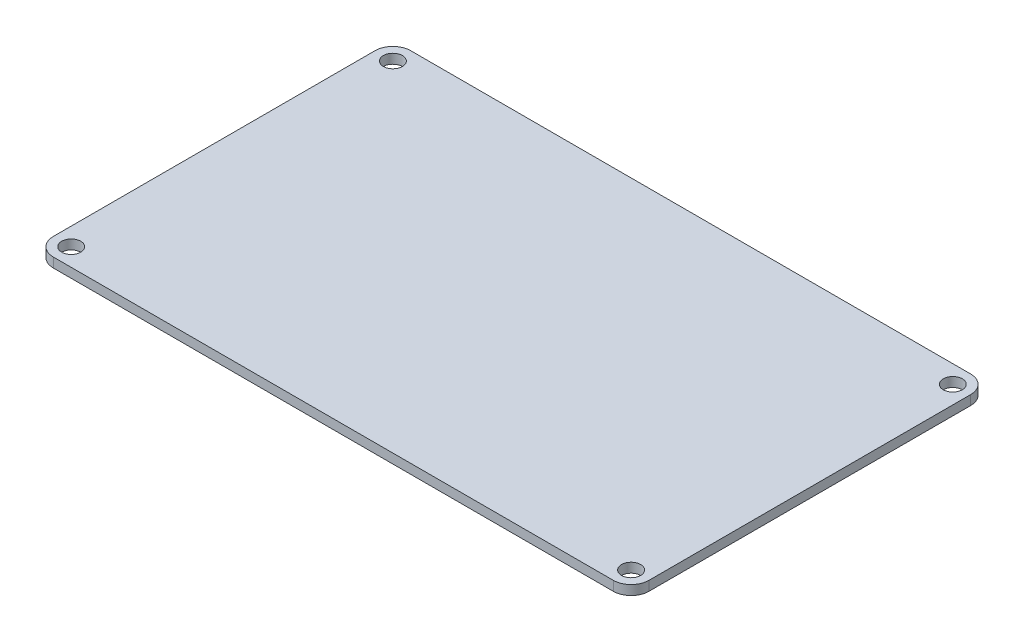
ISO-10303-21;
HEADER;
FILE_DESCRIPTION(('STEP AP214'),'2;1');
FILE_NAME('part.step','',(''),(''),'','','');
FILE_SCHEMA(('AUTOMOTIVE_DESIGN { 1 0 10303 214 1 1 1 1 }'));
ENDSEC;
DATA;
#1=APPLICATION_CONTEXT('core data for automotive mechanical design processes');
#2=APPLICATION_PROTOCOL_DEFINITION('international standard','automotive_design',2000,#1);
#3=PRODUCT_CONTEXT('',#1,'mechanical');
#4=PRODUCT('Part','Part','',(#3));
#5=PRODUCT_RELATED_PRODUCT_CATEGORY('part','',(#4));
#6=PRODUCT_DEFINITION_FORMATION('','',#4);
#7=PRODUCT_DEFINITION_CONTEXT('part definition',#1,'design');
#8=PRODUCT_DEFINITION('design','',#6,#7);
#9=PRODUCT_DEFINITION_SHAPE('','',#8);
#10=(LENGTH_UNIT() NAMED_UNIT(*) SI_UNIT(.MILLI.,.METRE.));
#11=(NAMED_UNIT(*) PLANE_ANGLE_UNIT() SI_UNIT($,.RADIAN.));
#12=(NAMED_UNIT(*) SI_UNIT($,.STERADIAN.) SOLID_ANGLE_UNIT());
#13=UNCERTAINTY_MEASURE_WITH_UNIT(LENGTH_MEASURE(1.E-05),#10,'distance_accuracy_value','');
#14=(GEOMETRIC_REPRESENTATION_CONTEXT(3) GLOBAL_UNCERTAINTY_ASSIGNED_CONTEXT((#13)) GLOBAL_UNIT_ASSIGNED_CONTEXT((#10,
#11,#12)) REPRESENTATION_CONTEXT('',''));
#15=CARTESIAN_POINT('',(0.,0.,0.));
#16=DIRECTION('',(0.,0.,1.));
#17=DIRECTION('',(1.,0.,0.));
#18=AXIS2_PLACEMENT_3D('',#15,#16,#17);
#19=CARTESIAN_POINT('',(-50.,1.6,30.));
#20=DIRECTION('',(0.,0.,-1.));
#21=DIRECTION('',(-1.,0.,0.));
#22=AXIS2_PLACEMENT_3D('',#19,#20,#21);
#23=PLANE('',#22);
#24=DIRECTION('',(1.,0.,0.));
#25=VECTOR('',#24,1.);
#26=CARTESIAN_POINT('',(-50.,0.,30.));
#27=LINE('',#26,#25);
#28=CARTESIAN_POINT('',(-47.,0.,30.));
#29=VERTEX_POINT('',#28);
#30=CARTESIAN_POINT('',(47.,0.,30.));
#31=VERTEX_POINT('',#30);
#32=EDGE_CURVE('E158',#29,#31,#27,.T.);
#33=ORIENTED_EDGE('',*,*,#32,.T.);
#34=DIRECTION('',(0.,-1.,0.));
#35=VECTOR('',#34,1.);
#36=CARTESIAN_POINT('',(47.,1.6,30.));
#37=LINE('',#36,#35);
#38=CARTESIAN_POINT('',(47.,1.6,30.));
#39=VERTEX_POINT('',#38);
#40=EDGE_CURVE('E145',#31,#39,#37,.F.);
#41=ORIENTED_EDGE('',*,*,#40,.T.);
#42=DIRECTION('',(1.,0.,0.));
#43=VECTOR('',#42,1.);
#44=CARTESIAN_POINT('',(-50.,1.6,30.));
#45=LINE('',#44,#43);
#46=CARTESIAN_POINT('',(-47.,1.6,30.));
#47=VERTEX_POINT('',#46);
#48=EDGE_CURVE('E160',#47,#39,#45,.T.);
#49=ORIENTED_EDGE('',*,*,#48,.F.);
#50=DIRECTION('',(0.,-1.,0.));
#51=VECTOR('',#50,1.);
#52=CARTESIAN_POINT('',(-47.,1.6,30.));
#53=LINE('',#52,#51);
#54=EDGE_CURVE('E142',#47,#29,#53,.T.);
#55=ORIENTED_EDGE('',*,*,#54,.T.);
#56=EDGE_LOOP('',(#33,#41,#49,#55));
#57=FACE_BOUND('',#56,.T.);
#58=ADVANCED_FACE('F33',(#57),#23,.F.);
#59=CARTESIAN_POINT('',(50.,1.6,-30.));
#60=DIRECTION('',(1.,0.,0.));
#61=DIRECTION('',(0.,0.,-1.));
#62=AXIS2_PLACEMENT_3D('',#59,#60,#61);
#63=PLANE('',#62);
#64=DIRECTION('',(0.,0.,1.));
#65=VECTOR('',#64,1.);
#66=CARTESIAN_POINT('',(50.,0.,-30.));
#67=LINE('',#66,#65);
#68=CARTESIAN_POINT('',(50.,0.,-27.));
#69=VERTEX_POINT('',#68);
#70=CARTESIAN_POINT('',(50.,0.,27.));
#71=VERTEX_POINT('',#70);
#72=EDGE_CURVE('E116',#69,#71,#67,.T.);
#73=ORIENTED_EDGE('',*,*,#72,.F.);
#74=DIRECTION('',(0.,-1.,0.));
#75=VECTOR('',#74,1.);
#76=CARTESIAN_POINT('',(50.,1.6,-27.));
#77=LINE('',#76,#75);
#78=CARTESIAN_POINT('',(50.,1.6,-27.));
#79=VERTEX_POINT('',#78);
#80=EDGE_CURVE('E133',#69,#79,#77,.F.);
#81=ORIENTED_EDGE('',*,*,#80,.T.);
#82=DIRECTION('',(0.,0.,1.));
#83=VECTOR('',#82,1.);
#84=CARTESIAN_POINT('',(50.,1.6,-30.));
#85=LINE('',#84,#83);
#86=CARTESIAN_POINT('',(50.,1.6,27.));
#87=VERTEX_POINT('',#86);
#88=EDGE_CURVE('E170',#79,#87,#85,.T.);
#89=ORIENTED_EDGE('',*,*,#88,.T.);
#90=DIRECTION('',(0.,-1.,0.));
#91=VECTOR('',#90,1.);
#92=CARTESIAN_POINT('',(50.,0.,27.));
#93=LINE('',#92,#91);
#94=EDGE_CURVE('E130',#87,#71,#93,.T.);
#95=ORIENTED_EDGE('',*,*,#94,.T.);
#96=EDGE_LOOP('',(#73,#81,#89,#95));
#97=FACE_BOUND('',#96,.T.);
#98=ADVANCED_FACE('F222',(#97),#63,.T.);
#99=CARTESIAN_POINT('',(-50.,1.6,-30.));
#100=DIRECTION('',(0.,0.,-1.));
#101=DIRECTION('',(-1.,0.,0.));
#102=AXIS2_PLACEMENT_3D('',#99,#100,#101);
#103=PLANE('',#102);
#104=DIRECTION('',(1.,0.,0.));
#105=VECTOR('',#104,1.);
#106=CARTESIAN_POINT('',(-50.,1.6,-30.));
#107=LINE('',#106,#105);
#108=CARTESIAN_POINT('',(-47.,1.6,-30.));
#109=VERTEX_POINT('',#108);
#110=CARTESIAN_POINT('',(47.,1.6,-30.));
#111=VERTEX_POINT('',#110);
#112=EDGE_CURVE('E121',#109,#111,#107,.T.);
#113=ORIENTED_EDGE('',*,*,#112,.T.);
#114=DIRECTION('',(0.,-1.,0.));
#115=VECTOR('',#114,1.);
#116=CARTESIAN_POINT('',(47.,1.6,-30.));
#117=LINE('',#116,#115);
#118=CARTESIAN_POINT('',(47.,0.,-30.));
#119=VERTEX_POINT('',#118);
#120=EDGE_CURVE('E108',#111,#119,#117,.T.);
#121=ORIENTED_EDGE('',*,*,#120,.T.);
#122=DIRECTION('',(1.,0.,0.));
#123=VECTOR('',#122,1.);
#124=CARTESIAN_POINT('',(-50.,0.,-30.));
#125=LINE('',#124,#123);
#126=CARTESIAN_POINT('',(-47.,0.,-30.));
#127=VERTEX_POINT('',#126);
#128=EDGE_CURVE('E101',#127,#119,#125,.T.);
#129=ORIENTED_EDGE('',*,*,#128,.F.);
#130=DIRECTION('',(0.,-1.,0.));
#131=VECTOR('',#130,1.);
#132=CARTESIAN_POINT('',(-47.,1.6,-30.));
#133=LINE('',#132,#131);
#134=EDGE_CURVE('E114',#127,#109,#133,.F.);
#135=ORIENTED_EDGE('',*,*,#134,.T.);
#136=EDGE_LOOP('',(#113,#121,#129,#135));
#137=FACE_BOUND('',#136,.T.);
#138=ADVANCED_FACE('F113',(#137),#103,.T.);
#139=CARTESIAN_POINT('',(-50.,1.6,-30.));
#140=DIRECTION('',(1.,0.,0.));
#141=DIRECTION('',(0.,0.,-1.));
#142=AXIS2_PLACEMENT_3D('',#139,#140,#141);
#143=PLANE('',#142);
#144=DIRECTION('',(0.,0.,1.));
#145=VECTOR('',#144,1.);
#146=CARTESIAN_POINT('',(-50.,0.,-30.));
#147=LINE('',#146,#145);
#148=CARTESIAN_POINT('',(-50.,0.,-27.));
#149=VERTEX_POINT('',#148);
#150=CARTESIAN_POINT('',(-50.,0.,27.));
#151=VERTEX_POINT('',#150);
#152=EDGE_CURVE('E102',#149,#151,#147,.T.);
#153=ORIENTED_EDGE('',*,*,#152,.T.);
#154=DIRECTION('',(0.,-1.,0.));
#155=VECTOR('',#154,1.);
#156=CARTESIAN_POINT('',(-50.,1.6,27.));
#157=LINE('',#156,#155);
#158=CARTESIAN_POINT('',(-50.,1.6,27.));
#159=VERTEX_POINT('',#158);
#160=EDGE_CURVE('E11',#151,#159,#157,.F.);
#161=ORIENTED_EDGE('',*,*,#160,.T.);
#162=DIRECTION('',(0.,0.,1.));
#163=VECTOR('',#162,1.);
#164=CARTESIAN_POINT('',(-50.,1.6,-30.));
#165=LINE('',#164,#163);
#166=CARTESIAN_POINT('',(-50.,1.6,-27.));
#167=VERTEX_POINT('',#166);
#168=EDGE_CURVE('E118',#167,#159,#165,.T.);
#169=ORIENTED_EDGE('',*,*,#168,.F.);
#170=DIRECTION('',(0.,-1.,0.));
#171=VECTOR('',#170,1.);
#172=CARTESIAN_POINT('',(-50.,0.,-27.));
#173=LINE('',#172,#171);
#174=EDGE_CURVE('E41',#167,#149,#173,.T.);
#175=ORIENTED_EDGE('',*,*,#174,.T.);
#176=EDGE_LOOP('',(#153,#161,#169,#175));
#177=FACE_BOUND('',#176,.T.);
#178=ADVANCED_FACE('F146',(#177),#143,.F.);
#179=CARTESIAN_POINT('',(0.,1.6,0.));
#180=DIRECTION('',(0.,-1.,0.));
#181=DIRECTION('',(0.,0.,-1.));
#182=AXIS2_PLACEMENT_3D('',#179,#180,#181);
#183=PLANE('',#182);
#184=CARTESIAN_POINT('',(-47.,1.6,27.));
#185=DIRECTION('',(0.,1.,0.));
#186=DIRECTION('',(0.,0.,-1.));
#187=AXIS2_PLACEMENT_3D('',#184,#185,#186);
#188=CIRCLE('',#187,1.6);
#189=CARTESIAN_POINT('',(-47.,1.6,25.4));
#190=VERTEX_POINT('',#189);
#191=EDGE_CURVE('E177',#190,#190,#188,.T.);
#192=ORIENTED_EDGE('',*,*,#191,.F.);
#193=EDGE_LOOP('',(#192));
#194=FACE_BOUND('',#193,.T.);
#195=CARTESIAN_POINT('',(47.,1.6,27.));
#196=DIRECTION('',(0.,1.,0.));
#197=DIRECTION('',(0.,0.,1.));
#198=AXIS2_PLACEMENT_3D('',#195,#196,#197);
#199=CIRCLE('',#198,1.6);
#200=CARTESIAN_POINT('',(47.,1.6,28.6));
#201=VERTEX_POINT('',#200);
#202=EDGE_CURVE('E183',#201,#201,#199,.T.);
#203=ORIENTED_EDGE('',*,*,#202,.F.);
#204=EDGE_LOOP('',(#203));
#205=FACE_BOUND('',#204,.T.);
#206=CARTESIAN_POINT('',(47.,1.6,-27.));
#207=DIRECTION('',(0.,1.,0.));
#208=DIRECTION('',(0.,0.,-1.));
#209=AXIS2_PLACEMENT_3D('',#206,#207,#208);
#210=CIRCLE('',#209,1.6);
#211=CARTESIAN_POINT('',(47.,1.6,-28.6));
#212=VERTEX_POINT('',#211);
#213=EDGE_CURVE('E189',#212,#212,#210,.T.);
#214=ORIENTED_EDGE('',*,*,#213,.F.);
#215=EDGE_LOOP('',(#214));
#216=FACE_BOUND('',#215,.T.);
#217=CARTESIAN_POINT('',(-47.,1.6,-27.));
#218=DIRECTION('',(0.,1.,0.));
#219=DIRECTION('',(0.,0.,1.));
#220=AXIS2_PLACEMENT_3D('',#217,#218,#219);
#221=CIRCLE('',#220,1.6);
#222=CARTESIAN_POINT('',(-47.,1.6,-25.4));
#223=VERTEX_POINT('',#222);
#224=EDGE_CURVE('E166',#223,#223,#221,.T.);
#225=ORIENTED_EDGE('',*,*,#224,.F.);
#226=EDGE_LOOP('',(#225));
#227=FACE_BOUND('',#226,.T.);
#228=ORIENTED_EDGE('',*,*,#88,.F.);
#229=CARTESIAN_POINT('',(47.,1.6,-27.));
#230=DIRECTION('',(0.,-1.,0.));
#231=DIRECTION('',(0.,0.,-1.));
#232=AXIS2_PLACEMENT_3D('',#229,#230,#231);
#233=CIRCLE('',#232,3.);
#234=EDGE_CURVE('E140',#79,#111,#233,.F.);
#235=ORIENTED_EDGE('',*,*,#234,.T.);
#236=ORIENTED_EDGE('',*,*,#112,.F.);
#237=CARTESIAN_POINT('',(-47.,1.6,-27.));
#238=DIRECTION('',(0.,-1.,0.));
#239=DIRECTION('',(0.,0.,-1.));
#240=AXIS2_PLACEMENT_3D('',#237,#238,#239);
#241=CIRCLE('',#240,3.);
#242=EDGE_CURVE('E53',#109,#167,#241,.F.);
#243=ORIENTED_EDGE('',*,*,#242,.T.);
#244=ORIENTED_EDGE('',*,*,#168,.T.);
#245=CARTESIAN_POINT('',(-47.,1.6,27.));
#246=DIRECTION('',(0.,-1.,0.));
#247=DIRECTION('',(0.,0.,-1.));
#248=AXIS2_PLACEMENT_3D('',#245,#246,#247);
#249=CIRCLE('',#248,3.);
#250=EDGE_CURVE('E136',#159,#47,#249,.F.);
#251=ORIENTED_EDGE('',*,*,#250,.T.);
#252=ORIENTED_EDGE('',*,*,#48,.T.);
#253=CARTESIAN_POINT('',(47.,1.6,27.));
#254=DIRECTION('',(0.,-1.,0.));
#255=DIRECTION('',(0.,0.,-1.));
#256=AXIS2_PLACEMENT_3D('',#253,#254,#255);
#257=CIRCLE('',#256,3.);
#258=EDGE_CURVE('E138',#39,#87,#257,.F.);
#259=ORIENTED_EDGE('',*,*,#258,.T.);
#260=EDGE_LOOP('',(#228,#235,#236,#243,#244,#251,#252,#259));
#261=FACE_BOUND('',#260,.T.);
#262=ADVANCED_FACE('F149',(#194,#205,#216,#227,#261),#183,.F.);
#263=CARTESIAN_POINT('',(0.,0.,0.));
#264=DIRECTION('',(0.,-1.,0.));
#265=DIRECTION('',(0.,0.,-1.));
#266=AXIS2_PLACEMENT_3D('',#263,#264,#265);
#267=PLANE('',#266);
#268=CARTESIAN_POINT('',(-47.,0.,27.));
#269=DIRECTION('',(0.,1.,0.));
#270=DIRECTION('',(0.,0.,-1.));
#271=AXIS2_PLACEMENT_3D('',#268,#269,#270);
#272=CIRCLE('',#271,1.6);
#273=CARTESIAN_POINT('',(-47.,0.,25.4));
#274=VERTEX_POINT('',#273);
#275=EDGE_CURVE('E180',#274,#274,#272,.T.);
#276=ORIENTED_EDGE('',*,*,#275,.T.);
#277=EDGE_LOOP('',(#276));
#278=FACE_BOUND('',#277,.T.);
#279=CARTESIAN_POINT('',(47.,0.,27.));
#280=DIRECTION('',(0.,1.,0.));
#281=DIRECTION('',(0.,0.,1.));
#282=AXIS2_PLACEMENT_3D('',#279,#280,#281);
#283=CIRCLE('',#282,1.6);
#284=CARTESIAN_POINT('',(47.,0.,28.6));
#285=VERTEX_POINT('',#284);
#286=EDGE_CURVE('E186',#285,#285,#283,.T.);
#287=ORIENTED_EDGE('',*,*,#286,.T.);
#288=EDGE_LOOP('',(#287));
#289=FACE_BOUND('',#288,.T.);
#290=CARTESIAN_POINT('',(47.,0.,-27.));
#291=DIRECTION('',(0.,1.,0.));
#292=DIRECTION('',(0.,0.,-1.));
#293=AXIS2_PLACEMENT_3D('',#290,#291,#292);
#294=CIRCLE('',#293,1.6);
#295=CARTESIAN_POINT('',(47.,0.,-28.6));
#296=VERTEX_POINT('',#295);
#297=EDGE_CURVE('E175',#296,#296,#294,.T.);
#298=ORIENTED_EDGE('',*,*,#297,.T.);
#299=EDGE_LOOP('',(#298));
#300=FACE_BOUND('',#299,.T.);
#301=CARTESIAN_POINT('',(-47.,0.,-27.));
#302=DIRECTION('',(0.,1.,0.));
#303=DIRECTION('',(0.,0.,1.));
#304=AXIS2_PLACEMENT_3D('',#301,#302,#303);
#305=CIRCLE('',#304,1.6);
#306=CARTESIAN_POINT('',(-47.,0.,-25.4));
#307=VERTEX_POINT('',#306);
#308=EDGE_CURVE('E162',#307,#307,#305,.T.);
#309=ORIENTED_EDGE('',*,*,#308,.T.);
#310=EDGE_LOOP('',(#309));
#311=FACE_BOUND('',#310,.T.);
#312=ORIENTED_EDGE('',*,*,#128,.T.);
#313=CARTESIAN_POINT('',(47.,0.,-27.));
#314=DIRECTION('',(0.,-1.,0.));
#315=DIRECTION('',(0.,0.,-1.));
#316=AXIS2_PLACEMENT_3D('',#313,#314,#315);
#317=CIRCLE('',#316,3.);
#318=EDGE_CURVE('E128',#119,#69,#317,.T.);
#319=ORIENTED_EDGE('',*,*,#318,.T.);
#320=ORIENTED_EDGE('',*,*,#72,.T.);
#321=CARTESIAN_POINT('',(47.,0.,27.));
#322=DIRECTION('',(0.,-1.,0.));
#323=DIRECTION('',(0.,0.,-1.));
#324=AXIS2_PLACEMENT_3D('',#321,#322,#323);
#325=CIRCLE('',#324,3.);
#326=EDGE_CURVE('E126',#71,#31,#325,.T.);
#327=ORIENTED_EDGE('',*,*,#326,.T.);
#328=ORIENTED_EDGE('',*,*,#32,.F.);
#329=CARTESIAN_POINT('',(-47.,0.,27.));
#330=DIRECTION('',(0.,-1.,0.));
#331=DIRECTION('',(0.,0.,-1.));
#332=AXIS2_PLACEMENT_3D('',#329,#330,#331);
#333=CIRCLE('',#332,3.);
#334=EDGE_CURVE('E107',#29,#151,#333,.T.);
#335=ORIENTED_EDGE('',*,*,#334,.T.);
#336=ORIENTED_EDGE('',*,*,#152,.F.);
#337=CARTESIAN_POINT('',(-47.,0.,-27.));
#338=DIRECTION('',(0.,-1.,0.));
#339=DIRECTION('',(0.,0.,-1.));
#340=AXIS2_PLACEMENT_3D('',#337,#338,#339);
#341=CIRCLE('',#340,3.);
#342=EDGE_CURVE('E98',#149,#127,#341,.T.);
#343=ORIENTED_EDGE('',*,*,#342,.T.);
#344=EDGE_LOOP('',(#312,#319,#320,#327,#328,#335,#336,#343));
#345=FACE_BOUND('',#344,.T.);
#346=ADVANCED_FACE('F100',(#278,#289,#300,#311,#345),#267,.T.);
#347=CARTESIAN_POINT('',(-47.,0.,-27.));
#348=DIRECTION('',(0.,1.,0.));
#349=DIRECTION('',(0.,0.,1.));
#350=AXIS2_PLACEMENT_3D('',#347,#348,#349);
#351=CYLINDRICAL_SURFACE('',#350,1.6);
#352=ORIENTED_EDGE('',*,*,#308,.F.);
#353=EDGE_LOOP('',(#352));
#354=FACE_BOUND('',#353,.T.);
#355=ORIENTED_EDGE('',*,*,#224,.T.);
#356=EDGE_LOOP('',(#355));
#357=FACE_BOUND('',#356,.T.);
#358=ADVANCED_FACE('F201',(#354,#357),#351,.F.);
#359=CARTESIAN_POINT('',(47.,0.,-27.));
#360=DIRECTION('',(0.,1.,0.));
#361=DIRECTION('',(0.,0.,1.));
#362=AXIS2_PLACEMENT_3D('',#359,#360,#361);
#363=CYLINDRICAL_SURFACE('',#362,1.6);
#364=ORIENTED_EDGE('',*,*,#297,.F.);
#365=EDGE_LOOP('',(#364));
#366=FACE_BOUND('',#365,.T.);
#367=ORIENTED_EDGE('',*,*,#213,.T.);
#368=EDGE_LOOP('',(#367));
#369=FACE_BOUND('',#368,.T.);
#370=ADVANCED_FACE('F197',(#366,#369),#363,.F.);
#371=CARTESIAN_POINT('',(47.,0.,27.));
#372=DIRECTION('',(0.,1.,0.));
#373=DIRECTION('',(0.,0.,1.));
#374=AXIS2_PLACEMENT_3D('',#371,#372,#373);
#375=CYLINDRICAL_SURFACE('',#374,1.6);
#376=ORIENTED_EDGE('',*,*,#286,.F.);
#377=EDGE_LOOP('',(#376));
#378=FACE_BOUND('',#377,.T.);
#379=ORIENTED_EDGE('',*,*,#202,.T.);
#380=EDGE_LOOP('',(#379));
#381=FACE_BOUND('',#380,.T.);
#382=ADVANCED_FACE('F200',(#378,#381),#375,.F.);
#383=CARTESIAN_POINT('',(-47.,0.,27.));
#384=DIRECTION('',(0.,1.,0.));
#385=DIRECTION('',(0.,0.,1.));
#386=AXIS2_PLACEMENT_3D('',#383,#384,#385);
#387=CYLINDRICAL_SURFACE('',#386,1.6);
#388=ORIENTED_EDGE('',*,*,#275,.F.);
#389=EDGE_LOOP('',(#388));
#390=FACE_BOUND('',#389,.T.);
#391=ORIENTED_EDGE('',*,*,#191,.T.);
#392=EDGE_LOOP('',(#391));
#393=FACE_BOUND('',#392,.T.);
#394=ADVANCED_FACE('F235',(#390,#393),#387,.F.);
#395=CARTESIAN_POINT('',(47.,1.6,-27.));
#396=DIRECTION('',(0.,-1.,0.));
#397=DIRECTION('',(0.,0.,-1.));
#398=AXIS2_PLACEMENT_3D('',#395,#396,#397);
#399=CYLINDRICAL_SURFACE('',#398,3.);
#400=ORIENTED_EDGE('',*,*,#234,.F.);
#401=ORIENTED_EDGE('',*,*,#80,.F.);
#402=ORIENTED_EDGE('',*,*,#318,.F.);
#403=ORIENTED_EDGE('',*,*,#120,.F.);
#404=EDGE_LOOP('',(#400,#401,#402,#403));
#405=FACE_BOUND('',#404,.T.);
#406=ADVANCED_FACE('F231',(#405),#399,.T.);
#407=CARTESIAN_POINT('',(47.,1.6,27.));
#408=DIRECTION('',(0.,1.,0.));
#409=DIRECTION('',(0.,0.,1.));
#410=AXIS2_PLACEMENT_3D('',#407,#408,#409);
#411=CYLINDRICAL_SURFACE('',#410,3.);
#412=ORIENTED_EDGE('',*,*,#258,.F.);
#413=ORIENTED_EDGE('',*,*,#40,.F.);
#414=ORIENTED_EDGE('',*,*,#326,.F.);
#415=ORIENTED_EDGE('',*,*,#94,.F.);
#416=EDGE_LOOP('',(#412,#413,#414,#415));
#417=FACE_BOUND('',#416,.T.);
#418=ADVANCED_FACE('F234',(#417),#411,.T.);
#419=CARTESIAN_POINT('',(-47.,1.6,27.));
#420=DIRECTION('',(0.,-1.,0.));
#421=DIRECTION('',(0.,0.,-1.));
#422=AXIS2_PLACEMENT_3D('',#419,#420,#421);
#423=CYLINDRICAL_SURFACE('',#422,3.);
#424=ORIENTED_EDGE('',*,*,#250,.F.);
#425=ORIENTED_EDGE('',*,*,#160,.F.);
#426=ORIENTED_EDGE('',*,*,#334,.F.);
#427=ORIENTED_EDGE('',*,*,#54,.F.);
#428=EDGE_LOOP('',(#424,#425,#426,#427));
#429=FACE_BOUND('',#428,.T.);
#430=ADVANCED_FACE('F154',(#429),#423,.T.);
#431=CARTESIAN_POINT('',(-47.,1.6,-27.));
#432=DIRECTION('',(0.,1.,0.));
#433=DIRECTION('',(0.,0.,1.));
#434=AXIS2_PLACEMENT_3D('',#431,#432,#433);
#435=CYLINDRICAL_SURFACE('',#434,3.);
#436=ORIENTED_EDGE('',*,*,#242,.F.);
#437=ORIENTED_EDGE('',*,*,#134,.F.);
#438=ORIENTED_EDGE('',*,*,#342,.F.);
#439=ORIENTED_EDGE('',*,*,#174,.F.);
#440=EDGE_LOOP('',(#436,#437,#438,#439));
#441=FACE_BOUND('',#440,.T.);
#442=ADVANCED_FACE('F35',(#441),#435,.T.);
#443=CLOSED_SHELL('',(#58,#98,#138,#178,#262,#346,#358,#370,#382,#394,#406,#418,#430,#442));
#444=MANIFOLD_SOLID_BREP('B2',#443);
#445=ADVANCED_BREP_SHAPE_REPRESENTATION('',(#18,#444),#14);
#446=SHAPE_DEFINITION_REPRESENTATION(#9,#445);
ENDSEC;
END-ISO-10303-21;
